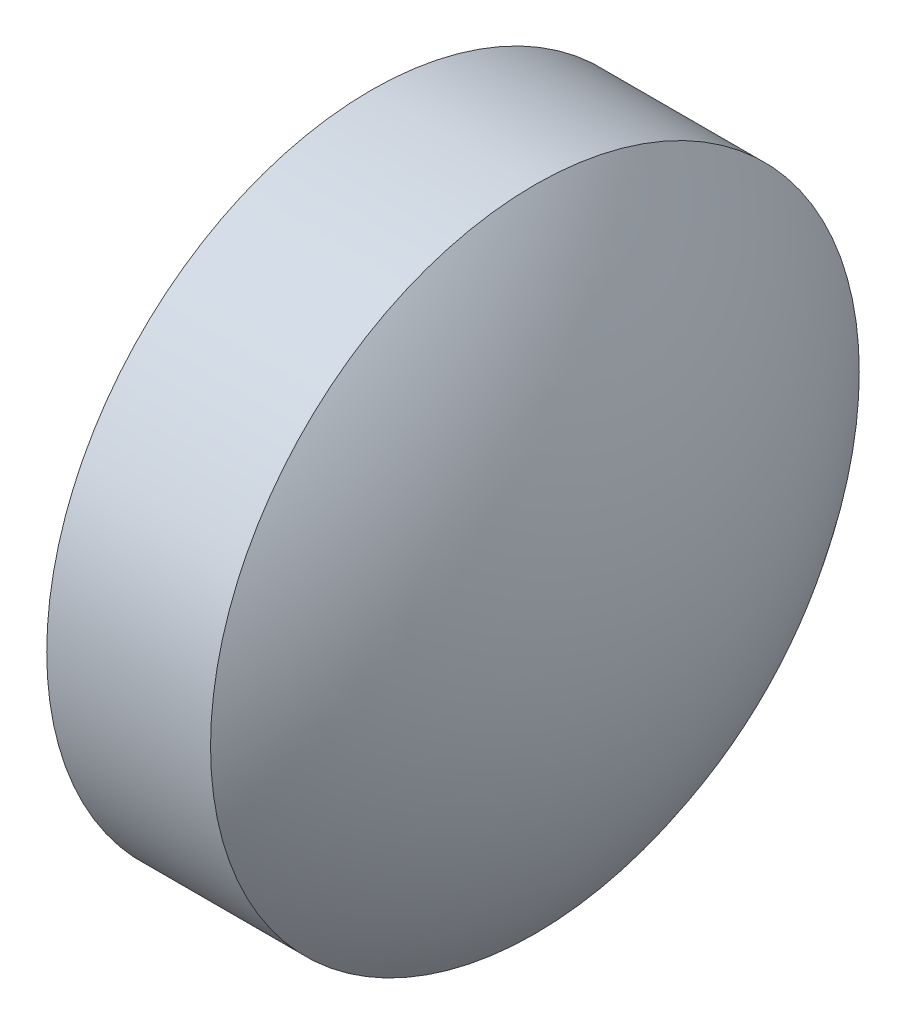
ISO-10303-21;
HEADER;
FILE_DESCRIPTION(('STEP AP214'),'2;1');
FILE_NAME('part.step','',(''),(''),'','','');
FILE_SCHEMA(('AUTOMOTIVE_DESIGN { 1 0 10303 214 1 1 1 1 }'));
ENDSEC;
DATA;
#1=APPLICATION_CONTEXT('core data for automotive mechanical design processes');
#2=APPLICATION_PROTOCOL_DEFINITION('international standard','automotive_design',2000,#1);
#3=PRODUCT_CONTEXT('',#1,'mechanical');
#4=PRODUCT('Part','Part','',(#3));
#5=PRODUCT_RELATED_PRODUCT_CATEGORY('part','',(#4));
#6=PRODUCT_DEFINITION_FORMATION('','',#4);
#7=PRODUCT_DEFINITION_CONTEXT('part definition',#1,'design');
#8=PRODUCT_DEFINITION('design','',#6,#7);
#9=PRODUCT_DEFINITION_SHAPE('','',#8);
#10=(LENGTH_UNIT() NAMED_UNIT(*) SI_UNIT(.MILLI.,.METRE.));
#11=(NAMED_UNIT(*) PLANE_ANGLE_UNIT() SI_UNIT($,.RADIAN.));
#12=(NAMED_UNIT(*) SI_UNIT($,.STERADIAN.) SOLID_ANGLE_UNIT());
#13=UNCERTAINTY_MEASURE_WITH_UNIT(LENGTH_MEASURE(1.E-05),#10,'distance_accuracy_value','');
#14=(GEOMETRIC_REPRESENTATION_CONTEXT(3) GLOBAL_UNCERTAINTY_ASSIGNED_CONTEXT((#13)) GLOBAL_UNIT_ASSIGNED_CONTEXT((#10,
#11,#12)) REPRESENTATION_CONTEXT('',''));
#15=CARTESIAN_POINT('',(0.,0.,0.));
#16=DIRECTION('',(0.,0.,1.));
#17=DIRECTION('',(1.,0.,0.));
#18=AXIS2_PLACEMENT_3D('',#15,#16,#17);
#19=CARTESIAN_POINT('',(503.636316676671,-76.1334734980208,0.));
#20=DIRECTION('',(-1.,0.,0.));
#21=DIRECTION('',(0.,1.,0.));
#22=AXIS2_PLACEMENT_3D('',#19,#20,#21);
#23=SPHERICAL_SURFACE('',#22,3.24355072463778);
#24=CARTESIAN_POINT('',(506.189867401308,-76.1334734980208,0.));
#25=DIRECTION('',(-1.,0.,0.));
#26=DIRECTION('',(0.,0.,1.));
#27=AXIS2_PLACEMENT_3D('',#24,#25,#26);
#28=CIRCLE('',#27,2.);
#29=CARTESIAN_POINT('',(506.189867401308,-76.1334734980208,2.));
#30=VERTEX_POINT('',#29);
#31=EDGE_CURVE('E10',#30,#30,#28,.T.);
#32=ORIENTED_EDGE('',*,*,#31,.F.);
#33=EDGE_LOOP('',(#32));
#34=FACE_BOUND('',#33,.T.);
#35=ADVANCED_FACE('F33',(#34),#23,.T.);
#36=CARTESIAN_POINT('',(504.749983264528,-76.1334734980208,0.));
#37=DIRECTION('',(-1.,0.,0.));
#38=DIRECTION('',(0.,0.,1.));
#39=AXIS2_PLACEMENT_3D('',#36,#37,#38);
#40=CYLINDRICAL_SURFACE('',#39,2.);
#41=CARTESIAN_POINT('',(505.179867401308,-76.1334734980208,0.));
#42=DIRECTION('',(-1.,0.,0.));
#43=DIRECTION('',(0.,0.,1.));
#44=AXIS2_PLACEMENT_3D('',#41,#42,#43);
#45=CIRCLE('',#44,2.);
#46=CARTESIAN_POINT('',(505.179867401308,-76.1334734980208,2.));
#47=VERTEX_POINT('',#46);
#48=EDGE_CURVE('E39',#47,#47,#45,.T.);
#49=ORIENTED_EDGE('',*,*,#48,.F.);
#50=EDGE_LOOP('',(#49));
#51=FACE_BOUND('',#50,.T.);
#52=ORIENTED_EDGE('',*,*,#31,.T.);
#53=EDGE_LOOP('',(#52));
#54=FACE_BOUND('',#53,.T.);
#55=ADVANCED_FACE('F47',(#51,#54),#40,.T.);
#56=CARTESIAN_POINT('',(505.179867401308,-76.1334734980208,0.));
#57=DIRECTION('',(1.,0.,0.));
#58=DIRECTION('',(0.,0.,-1.));
#59=AXIS2_PLACEMENT_3D('',#56,#57,#58);
#60=PLANE('',#59);
#61=ORIENTED_EDGE('',*,*,#48,.T.);
#62=EDGE_LOOP('',(#61));
#63=FACE_BOUND('',#62,.T.);
#64=ADVANCED_FACE('F45',(#63),#60,.F.);
#65=CLOSED_SHELL('',(#35,#55,#64));
#66=MANIFOLD_SOLID_BREP('B2',#65);
#67=ADVANCED_BREP_SHAPE_REPRESENTATION('',(#18,#66),#14);
#68=SHAPE_DEFINITION_REPRESENTATION(#9,#67);
ENDSEC;
END-ISO-10303-21;
